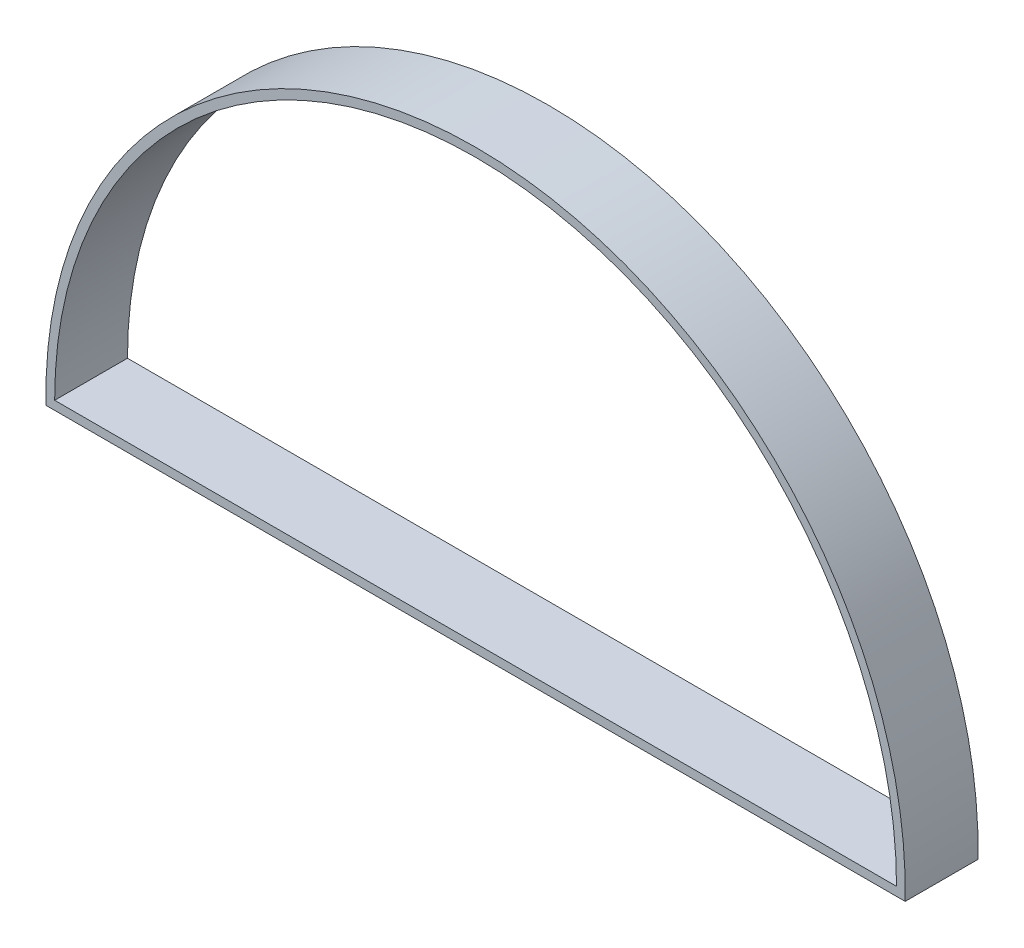
ISO-10303-21;
HEADER;
FILE_DESCRIPTION(('STEP AP214'),'2;1');
FILE_NAME('part.step','',(''),(''),'','','');
FILE_SCHEMA(('AUTOMOTIVE_DESIGN { 1 0 10303 214 1 1 1 1 }'));
ENDSEC;
DATA;
#1=APPLICATION_CONTEXT('core data for automotive mechanical design processes');
#2=APPLICATION_PROTOCOL_DEFINITION('international standard','automotive_design',2000,#1);
#3=PRODUCT_CONTEXT('',#1,'mechanical');
#4=PRODUCT('Part','Part','',(#3));
#5=PRODUCT_RELATED_PRODUCT_CATEGORY('part','',(#4));
#6=PRODUCT_DEFINITION_FORMATION('','',#4);
#7=PRODUCT_DEFINITION_CONTEXT('part definition',#1,'design');
#8=PRODUCT_DEFINITION('design','',#6,#7);
#9=PRODUCT_DEFINITION_SHAPE('','',#8);
#10=(LENGTH_UNIT() NAMED_UNIT(*) SI_UNIT(.MILLI.,.METRE.));
#11=(NAMED_UNIT(*) PLANE_ANGLE_UNIT() SI_UNIT($,.RADIAN.));
#12=(NAMED_UNIT(*) SI_UNIT($,.STERADIAN.) SOLID_ANGLE_UNIT());
#13=UNCERTAINTY_MEASURE_WITH_UNIT(LENGTH_MEASURE(1.E-05),#10,'distance_accuracy_value','');
#14=(GEOMETRIC_REPRESENTATION_CONTEXT(3) GLOBAL_UNCERTAINTY_ASSIGNED_CONTEXT((#13)) GLOBAL_UNIT_ASSIGNED_CONTEXT((#10,
#11,#12)) REPRESENTATION_CONTEXT('',''));
#15=CARTESIAN_POINT('',(0.,0.,0.));
#16=DIRECTION('',(0.,0.,1.));
#17=DIRECTION('',(1.,0.,0.));
#18=AXIS2_PLACEMENT_3D('',#15,#16,#17);
#19=CARTESIAN_POINT('',(144.5,0.,25.));
#20=DIRECTION('',(0.,0.,-1.));
#21=DIRECTION('',(-1.,0.,0.));
#22=AXIS2_PLACEMENT_3D('',#19,#20,#21);
#23=PLANE('',#22);
#24=CARTESIAN_POINT('',(144.5,0.,25.));
#25=DIRECTION('',(0.,0.,-1.));
#26=DIRECTION('',(-1.,0.,0.));
#27=AXIS2_PLACEMENT_3D('',#24,#25,#26);
#28=CIRCLE('',#27,147.5);
#29=CARTESIAN_POINT('',(291.969488369628,-3.,25.));
#30=VERTEX_POINT('',#29);
#31=CARTESIAN_POINT('',(-2.96948836962853,-3.,25.));
#32=VERTEX_POINT('',#31);
#33=EDGE_CURVE('E105',#30,#32,#28,.F.);
#34=ORIENTED_EDGE('',*,*,#33,.T.);
#35=DIRECTION('',(1.,0.,0.));
#36=VECTOR('',#35,1.);
#37=CARTESIAN_POINT('',(144.5,-3.,25.));
#38=LINE('',#37,#36);
#39=EDGE_CURVE('E108',#32,#30,#38,.T.);
#40=ORIENTED_EDGE('',*,*,#39,.T.);
#41=EDGE_LOOP('',(#34,#40));
#42=FACE_BOUND('',#41,.T.);
#43=CARTESIAN_POINT('',(144.5,0.,25.));
#44=DIRECTION('',(0.,0.,1.));
#45=DIRECTION('',(-1.,0.,0.));
#46=AXIS2_PLACEMENT_3D('',#43,#44,#45);
#47=CIRCLE('',#46,144.5);
#48=CARTESIAN_POINT('',(289.,0.,25.));
#49=VERTEX_POINT('',#48);
#50=CARTESIAN_POINT('',(0.,0.,25.));
#51=VERTEX_POINT('',#50);
#52=EDGE_CURVE('E94',#49,#51,#47,.T.);
#53=ORIENTED_EDGE('',*,*,#52,.F.);
#54=DIRECTION('',(1.,0.,0.));
#55=VECTOR('',#54,1.);
#56=CARTESIAN_POINT('',(0.,0.,25.));
#57=LINE('',#56,#55);
#58=EDGE_CURVE('E88',#51,#49,#57,.T.);
#59=ORIENTED_EDGE('',*,*,#58,.F.);
#60=EDGE_LOOP('',(#53,#59));
#61=FACE_BOUND('',#60,.T.);
#62=ADVANCED_FACE('F48',(#42,#61),#23,.F.);
#63=CARTESIAN_POINT('',(144.5,0.,0.));
#64=DIRECTION('',(0.,0.,-1.));
#65=DIRECTION('',(-1.,0.,0.));
#66=AXIS2_PLACEMENT_3D('',#63,#64,#65);
#67=PLANE('',#66);
#68=CARTESIAN_POINT('',(144.5,0.,0.));
#69=DIRECTION('',(0.,0.,-1.));
#70=DIRECTION('',(-1.,0.,0.));
#71=AXIS2_PLACEMENT_3D('',#68,#69,#70);
#72=CIRCLE('',#71,147.5);
#73=CARTESIAN_POINT('',(291.969488369628,-3.,0.));
#74=VERTEX_POINT('',#73);
#75=CARTESIAN_POINT('',(-2.96948836962853,-3.,0.));
#76=VERTEX_POINT('',#75);
#77=EDGE_CURVE('E104',#74,#76,#72,.F.);
#78=ORIENTED_EDGE('',*,*,#77,.F.);
#79=DIRECTION('',(1.,0.,0.));
#80=VECTOR('',#79,1.);
#81=CARTESIAN_POINT('',(144.5,-3.00000000000002,0.));
#82=LINE('',#81,#80);
#83=EDGE_CURVE('E109',#76,#74,#82,.T.);
#84=ORIENTED_EDGE('',*,*,#83,.F.);
#85=EDGE_LOOP('',(#78,#84));
#86=FACE_BOUND('',#85,.T.);
#87=DIRECTION('',(1.,0.,0.));
#88=VECTOR('',#87,1.);
#89=CARTESIAN_POINT('',(289.,0.,0.));
#90=LINE('',#89,#88);
#91=CARTESIAN_POINT('',(0.,0.,0.));
#92=VERTEX_POINT('',#91);
#93=CARTESIAN_POINT('',(289.,0.,0.));
#94=VERTEX_POINT('',#93);
#95=EDGE_CURVE('E98',#92,#94,#90,.T.);
#96=ORIENTED_EDGE('',*,*,#95,.T.);
#97=CARTESIAN_POINT('',(144.5,0.,0.));
#98=DIRECTION('',(0.,0.,1.));
#99=DIRECTION('',(-1.,0.,0.));
#100=AXIS2_PLACEMENT_3D('',#97,#98,#99);
#101=CIRCLE('',#100,144.5);
#102=EDGE_CURVE('E70',#94,#92,#101,.T.);
#103=ORIENTED_EDGE('',*,*,#102,.T.);
#104=EDGE_LOOP('',(#96,#103));
#105=FACE_BOUND('',#104,.T.);
#106=ADVANCED_FACE('F121',(#86,#105),#67,.T.);
#107=CARTESIAN_POINT('',(144.5,0.,25.));
#108=DIRECTION('',(0.,0.,-1.));
#109=DIRECTION('',(-1.,0.,0.));
#110=AXIS2_PLACEMENT_3D('',#107,#108,#109);
#111=CYLINDRICAL_SURFACE('',#110,147.5);
#112=ORIENTED_EDGE('',*,*,#77,.T.);
#113=DIRECTION('',(0.,0.,-1.));
#114=VECTOR('',#113,1.);
#115=CARTESIAN_POINT('',(-2.96948836962853,-3.,25.));
#116=LINE('',#115,#114);
#117=EDGE_CURVE('E12',#32,#76,#116,.T.);
#118=ORIENTED_EDGE('',*,*,#117,.F.);
#119=ORIENTED_EDGE('',*,*,#33,.F.);
#120=DIRECTION('',(0.,0.,-1.));
#121=VECTOR('',#120,1.);
#122=CARTESIAN_POINT('',(291.969488369628,-3.,25.));
#123=LINE('',#122,#121);
#124=EDGE_CURVE('E56',#30,#74,#123,.T.);
#125=ORIENTED_EDGE('',*,*,#124,.T.);
#126=EDGE_LOOP('',(#112,#118,#119,#125));
#127=FACE_BOUND('',#126,.T.);
#128=ADVANCED_FACE('F50',(#127),#111,.T.);
#129=CARTESIAN_POINT('',(144.5,-3.00000000000002,25.));
#130=DIRECTION('',(0.,1.,0.));
#131=DIRECTION('',(-1.,0.,0.));
#132=AXIS2_PLACEMENT_3D('',#129,#130,#131);
#133=PLANE('',#132);
#134=ORIENTED_EDGE('',*,*,#83,.T.);
#135=ORIENTED_EDGE('',*,*,#124,.F.);
#136=ORIENTED_EDGE('',*,*,#39,.F.);
#137=ORIENTED_EDGE('',*,*,#117,.T.);
#138=EDGE_LOOP('',(#134,#135,#136,#137));
#139=FACE_BOUND('',#138,.T.);
#140=ADVANCED_FACE('F123',(#139),#133,.F.);
#141=CARTESIAN_POINT('',(144.5,0.,25.));
#142=DIRECTION('',(0.,0.,-1.));
#143=DIRECTION('',(-1.,0.,0.));
#144=AXIS2_PLACEMENT_3D('',#141,#142,#143);
#145=CYLINDRICAL_SURFACE('',#144,144.5);
#146=ORIENTED_EDGE('',*,*,#102,.F.);
#147=DIRECTION('',(0.,0.,-1.));
#148=VECTOR('',#147,1.);
#149=CARTESIAN_POINT('',(289.,0.,25.));
#150=LINE('',#149,#148);
#151=EDGE_CURVE('E90',#49,#94,#150,.T.);
#152=ORIENTED_EDGE('',*,*,#151,.F.);
#153=ORIENTED_EDGE('',*,*,#52,.T.);
#154=DIRECTION('',(0.,0.,-1.));
#155=VECTOR('',#154,1.);
#156=CARTESIAN_POINT('',(0.,0.,25.));
#157=LINE('',#156,#155);
#158=EDGE_CURVE('E63',#51,#92,#157,.T.);
#159=ORIENTED_EDGE('',*,*,#158,.T.);
#160=EDGE_LOOP('',(#146,#152,#153,#159));
#161=FACE_BOUND('',#160,.T.);
#162=ADVANCED_FACE('F96',(#161),#145,.F.);
#163=CARTESIAN_POINT('',(289.,0.,25.));
#164=DIRECTION('',(0.,1.,0.));
#165=DIRECTION('',(-1.,0.,0.));
#166=AXIS2_PLACEMENT_3D('',#163,#164,#165);
#167=PLANE('',#166);
#168=ORIENTED_EDGE('',*,*,#95,.F.);
#169=ORIENTED_EDGE('',*,*,#158,.F.);
#170=ORIENTED_EDGE('',*,*,#58,.T.);
#171=ORIENTED_EDGE('',*,*,#151,.T.);
#172=EDGE_LOOP('',(#168,#169,#170,#171));
#173=FACE_BOUND('',#172,.T.);
#174=ADVANCED_FACE('F89',(#173),#167,.T.);
#175=CLOSED_SHELL('',(#62,#106,#128,#140,#162,#174));
#176=MANIFOLD_SOLID_BREP('B2',#175);
#177=ADVANCED_BREP_SHAPE_REPRESENTATION('',(#18,#176),#14);
#178=SHAPE_DEFINITION_REPRESENTATION(#9,#177);
ENDSEC;
END-ISO-10303-21;
